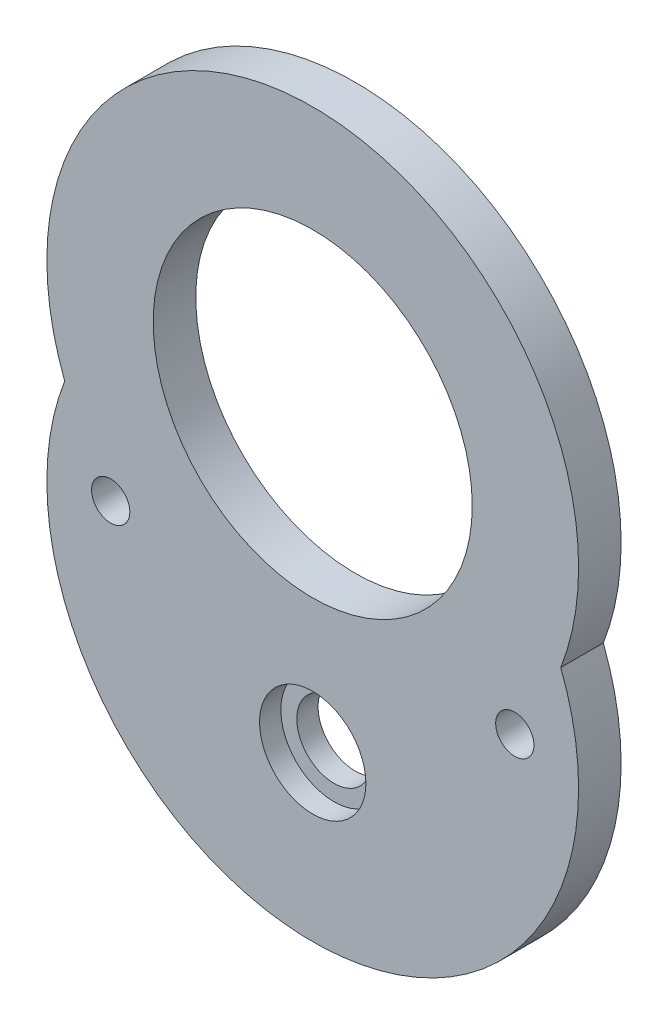
ISO-10303-21;
HEADER;
FILE_DESCRIPTION(('STEP AP214'),'2;1');
FILE_NAME('part.step','',(''),(''),'','','');
FILE_SCHEMA(('AUTOMOTIVE_DESIGN { 1 0 10303 214 1 1 1 1 }'));
ENDSEC;
DATA;
#1=APPLICATION_CONTEXT('core data for automotive mechanical design processes');
#2=APPLICATION_PROTOCOL_DEFINITION('international standard','automotive_design',2000,#1);
#3=PRODUCT_CONTEXT('',#1,'mechanical');
#4=PRODUCT('Part','Part','',(#3));
#5=PRODUCT_RELATED_PRODUCT_CATEGORY('part','',(#4));
#6=PRODUCT_DEFINITION_FORMATION('','',#4);
#7=PRODUCT_DEFINITION_CONTEXT('part definition',#1,'design');
#8=PRODUCT_DEFINITION('design','',#6,#7);
#9=PRODUCT_DEFINITION_SHAPE('','',#8);
#10=(LENGTH_UNIT() NAMED_UNIT(*) SI_UNIT(.MILLI.,.METRE.));
#11=(NAMED_UNIT(*) PLANE_ANGLE_UNIT() SI_UNIT($,.RADIAN.));
#12=(NAMED_UNIT(*) SI_UNIT($,.STERADIAN.) SOLID_ANGLE_UNIT());
#13=UNCERTAINTY_MEASURE_WITH_UNIT(LENGTH_MEASURE(1.E-05),#10,'distance_accuracy_value','');
#14=(GEOMETRIC_REPRESENTATION_CONTEXT(3) GLOBAL_UNCERTAINTY_ASSIGNED_CONTEXT((#13)) GLOBAL_UNIT_ASSIGNED_CONTEXT((#10,
#11,#12)) REPRESENTATION_CONTEXT('',''));
#15=CARTESIAN_POINT('',(0.,0.,0.));
#16=DIRECTION('',(0.,0.,1.));
#17=DIRECTION('',(1.,0.,0.));
#18=AXIS2_PLACEMENT_3D('',#15,#16,#17);
#19=CARTESIAN_POINT('',(0.,-13.8,2.));
#20=DIRECTION('',(0.,0.,-1.));
#21=DIRECTION('',(-1.,0.,0.));
#22=AXIS2_PLACEMENT_3D('',#19,#20,#21);
#23=CYLINDRICAL_SURFACE('',#22,1.75);
#24=CARTESIAN_POINT('',(0.,-13.8,0.));
#25=DIRECTION('',(0.,0.,1.));
#26=DIRECTION('',(1.,0.,0.));
#27=AXIS2_PLACEMENT_3D('',#24,#25,#26);
#28=CIRCLE('',#27,1.75);
#29=CARTESIAN_POINT('',(1.75,-13.8,0.));
#30=VERTEX_POINT('',#29);
#31=EDGE_CURVE('E85',#30,#30,#28,.T.);
#32=ORIENTED_EDGE('',*,*,#31,.F.);
#33=EDGE_LOOP('',(#32));
#34=FACE_BOUND('',#33,.T.);
#35=CARTESIAN_POINT('',(0.,-13.8,1.));
#36=DIRECTION('',(0.,0.,1.));
#37=DIRECTION('',(1.,0.,0.));
#38=AXIS2_PLACEMENT_3D('',#35,#36,#37);
#39=CIRCLE('',#38,1.75);
#40=CARTESIAN_POINT('',(1.75,-13.8,1.));
#41=VERTEX_POINT('',#40);
#42=EDGE_CURVE('E41',#41,#41,#39,.T.);
#43=ORIENTED_EDGE('',*,*,#42,.T.);
#44=EDGE_LOOP('',(#43));
#45=FACE_BOUND('',#44,.T.);
#46=ADVANCED_FACE('F37',(#34,#45),#23,.F.);
#47=CARTESIAN_POINT('',(0.,-4.5,2.));
#48=DIRECTION('',(0.,0.,1.));
#49=DIRECTION('',(1.,0.,0.));
#50=AXIS2_PLACEMENT_3D('',#47,#48,#49);
#51=PLANE('',#50);
#52=CARTESIAN_POINT('',(0.,-13.8,2.));
#53=DIRECTION('',(0.,0.,1.));
#54=DIRECTION('',(1.,0.,0.));
#55=AXIS2_PLACEMENT_3D('',#52,#53,#54);
#56=CIRCLE('',#55,2.5);
#57=CARTESIAN_POINT('',(2.5,-13.8,2.));
#58=VERTEX_POINT('',#57);
#59=EDGE_CURVE('E101',#58,#58,#56,.T.);
#60=ORIENTED_EDGE('',*,*,#59,.F.);
#61=EDGE_LOOP('',(#60));
#62=FACE_BOUND('',#61,.T.);
#63=CARTESIAN_POINT('',(-9.5,-8.3,2.));
#64=DIRECTION('',(0.,0.,1.));
#65=DIRECTION('',(1.,0.,0.));
#66=AXIS2_PLACEMENT_3D('',#63,#64,#65);
#67=CIRCLE('',#66,0.9);
#68=CARTESIAN_POINT('',(-8.6,-8.3,2.));
#69=VERTEX_POINT('',#68);
#70=EDGE_CURVE('E89',#69,#69,#67,.T.);
#71=ORIENTED_EDGE('',*,*,#70,.F.);
#72=EDGE_LOOP('',(#71));
#73=FACE_BOUND('',#72,.T.);
#74=CARTESIAN_POINT('',(0.,0.,2.));
#75=DIRECTION('',(0.,0.,1.));
#76=DIRECTION('',(1.,0.,0.));
#77=AXIS2_PLACEMENT_3D('',#74,#75,#76);
#78=CIRCLE('',#77,7.5);
#79=CARTESIAN_POINT('',(7.5,0.,2.));
#80=VERTEX_POINT('',#79);
#81=EDGE_CURVE('E76',#80,#80,#78,.T.);
#82=ORIENTED_EDGE('',*,*,#81,.F.);
#83=EDGE_LOOP('',(#82));
#84=FACE_BOUND('',#83,.T.);
#85=CARTESIAN_POINT('',(0.,-9.,2.));
#86=DIRECTION('',(0.,0.,1.));
#87=DIRECTION('',(1.,0.,0.));
#88=AXIS2_PLACEMENT_3D('',#85,#86,#87);
#89=CIRCLE('',#88,12.5);
#90=CARTESIAN_POINT('',(-11.6619037896906,-4.5,2.));
#91=VERTEX_POINT('',#90);
#92=CARTESIAN_POINT('',(11.6619037896906,-4.5,2.));
#93=VERTEX_POINT('',#92);
#94=EDGE_CURVE('E69',#91,#93,#89,.T.);
#95=ORIENTED_EDGE('',*,*,#94,.T.);
#96=CARTESIAN_POINT('',(0.,0.,2.));
#97=DIRECTION('',(0.,0.,1.));
#98=DIRECTION('',(1.,0.,0.));
#99=AXIS2_PLACEMENT_3D('',#96,#97,#98);
#100=CIRCLE('',#99,12.5);
#101=EDGE_CURVE('E54',#93,#91,#100,.T.);
#102=ORIENTED_EDGE('',*,*,#101,.T.);
#103=EDGE_LOOP('',(#95,#102));
#104=FACE_BOUND('',#103,.T.);
#105=CARTESIAN_POINT('',(9.5,-8.3,2.));
#106=DIRECTION('',(0.,0.,1.));
#107=DIRECTION('',(-1.,0.,0.));
#108=AXIS2_PLACEMENT_3D('',#105,#106,#107);
#109=CIRCLE('',#108,0.9);
#110=CARTESIAN_POINT('',(8.6,-8.3,2.));
#111=VERTEX_POINT('',#110);
#112=EDGE_CURVE('E93',#111,#111,#109,.T.);
#113=ORIENTED_EDGE('',*,*,#112,.F.);
#114=EDGE_LOOP('',(#113));
#115=FACE_BOUND('',#114,.T.);
#116=ADVANCED_FACE('F123',(#62,#73,#84,#104,#115),#51,.T.);
#117=CARTESIAN_POINT('',(0.,-4.5,0.));
#118=DIRECTION('',(0.,0.,1.));
#119=DIRECTION('',(1.,0.,0.));
#120=AXIS2_PLACEMENT_3D('',#117,#118,#119);
#121=PLANE('',#120);
#122=CARTESIAN_POINT('',(0.,-9.,0.));
#123=DIRECTION('',(0.,0.,1.));
#124=DIRECTION('',(1.,0.,0.));
#125=AXIS2_PLACEMENT_3D('',#122,#123,#124);
#126=CIRCLE('',#125,12.5);
#127=CARTESIAN_POINT('',(-11.6619037896906,-4.5,0.));
#128=VERTEX_POINT('',#127);
#129=CARTESIAN_POINT('',(11.6619037896906,-4.5,0.));
#130=VERTEX_POINT('',#129);
#131=EDGE_CURVE('E70',#128,#130,#126,.T.);
#132=ORIENTED_EDGE('',*,*,#131,.F.);
#133=CARTESIAN_POINT('',(0.,0.,0.));
#134=DIRECTION('',(0.,0.,1.));
#135=DIRECTION('',(1.,0.,0.));
#136=AXIS2_PLACEMENT_3D('',#133,#134,#135);
#137=CIRCLE('',#136,12.5);
#138=EDGE_CURVE('E62',#130,#128,#137,.T.);
#139=ORIENTED_EDGE('',*,*,#138,.F.);
#140=EDGE_LOOP('',(#132,#139));
#141=FACE_BOUND('',#140,.T.);
#142=CARTESIAN_POINT('',(0.,0.,0.));
#143=DIRECTION('',(0.,0.,1.));
#144=DIRECTION('',(1.,0.,0.));
#145=AXIS2_PLACEMENT_3D('',#142,#143,#144);
#146=CIRCLE('',#145,7.5);
#147=CARTESIAN_POINT('',(7.5,0.,0.));
#148=VERTEX_POINT('',#147);
#149=EDGE_CURVE('E79',#148,#148,#146,.T.);
#150=ORIENTED_EDGE('',*,*,#149,.T.);
#151=EDGE_LOOP('',(#150));
#152=FACE_BOUND('',#151,.T.);
#153=ORIENTED_EDGE('',*,*,#31,.T.);
#154=EDGE_LOOP('',(#153));
#155=FACE_BOUND('',#154,.T.);
#156=CARTESIAN_POINT('',(-9.5,-8.3,0.));
#157=DIRECTION('',(0.,0.,1.));
#158=DIRECTION('',(1.,0.,0.));
#159=AXIS2_PLACEMENT_3D('',#156,#157,#158);
#160=CIRCLE('',#159,0.9);
#161=CARTESIAN_POINT('',(-8.6,-8.3,0.));
#162=VERTEX_POINT('',#161);
#163=EDGE_CURVE('E90',#162,#162,#160,.T.);
#164=ORIENTED_EDGE('',*,*,#163,.T.);
#165=EDGE_LOOP('',(#164));
#166=FACE_BOUND('',#165,.T.);
#167=CARTESIAN_POINT('',(9.5,-8.3,0.));
#168=DIRECTION('',(0.,0.,1.));
#169=DIRECTION('',(-1.,0.,0.));
#170=AXIS2_PLACEMENT_3D('',#167,#168,#169);
#171=CIRCLE('',#170,0.9);
#172=CARTESIAN_POINT('',(8.6,-8.3,0.));
#173=VERTEX_POINT('',#172);
#174=EDGE_CURVE('E96',#173,#173,#171,.T.);
#175=ORIENTED_EDGE('',*,*,#174,.T.);
#176=EDGE_LOOP('',(#175));
#177=FACE_BOUND('',#176,.T.);
#178=ADVANCED_FACE('F74',(#141,#152,#155,#166,#177),#121,.F.);
#179=CARTESIAN_POINT('',(0.,-9.,2.));
#180=DIRECTION('',(0.,0.,-1.));
#181=DIRECTION('',(-1.,0.,0.));
#182=AXIS2_PLACEMENT_3D('',#179,#180,#181);
#183=CYLINDRICAL_SURFACE('',#182,12.5);
#184=ORIENTED_EDGE('',*,*,#131,.T.);
#185=DIRECTION('',(0.,0.,-1.));
#186=VECTOR('',#185,1.);
#187=CARTESIAN_POINT('',(11.6619037896906,-4.5,2.));
#188=LINE('',#187,#186);
#189=EDGE_CURVE('E11',#93,#130,#188,.T.);
#190=ORIENTED_EDGE('',*,*,#189,.F.);
#191=ORIENTED_EDGE('',*,*,#94,.F.);
#192=DIRECTION('',(0.,0.,-1.));
#193=VECTOR('',#192,1.);
#194=CARTESIAN_POINT('',(-11.6619037896906,-4.5,2.));
#195=LINE('',#194,#193);
#196=EDGE_CURVE('E47',#91,#128,#195,.T.);
#197=ORIENTED_EDGE('',*,*,#196,.T.);
#198=EDGE_LOOP('',(#184,#190,#191,#197));
#199=FACE_BOUND('',#198,.T.);
#200=ADVANCED_FACE('F39',(#199),#183,.T.);
#201=CARTESIAN_POINT('',(0.,0.,2.));
#202=DIRECTION('',(0.,0.,-1.));
#203=DIRECTION('',(-1.,0.,0.));
#204=AXIS2_PLACEMENT_3D('',#201,#202,#203);
#205=CYLINDRICAL_SURFACE('',#204,12.5);
#206=ORIENTED_EDGE('',*,*,#138,.T.);
#207=ORIENTED_EDGE('',*,*,#196,.F.);
#208=ORIENTED_EDGE('',*,*,#101,.F.);
#209=ORIENTED_EDGE('',*,*,#189,.T.);
#210=EDGE_LOOP('',(#206,#207,#208,#209));
#211=FACE_BOUND('',#210,.T.);
#212=ADVANCED_FACE('F65',(#211),#205,.T.);
#213=CARTESIAN_POINT('',(0.,0.,2.));
#214=DIRECTION('',(0.,0.,-1.));
#215=DIRECTION('',(-1.,0.,0.));
#216=AXIS2_PLACEMENT_3D('',#213,#214,#215);
#217=CYLINDRICAL_SURFACE('',#216,7.5);
#218=ORIENTED_EDGE('',*,*,#81,.T.);
#219=EDGE_LOOP('',(#218));
#220=FACE_BOUND('',#219,.T.);
#221=ORIENTED_EDGE('',*,*,#149,.F.);
#222=EDGE_LOOP('',(#221));
#223=FACE_BOUND('',#222,.T.);
#224=ADVANCED_FACE('F136',(#220,#223),#217,.F.);
#225=CARTESIAN_POINT('',(-9.5,-8.3,2.));
#226=DIRECTION('',(0.,0.,-1.));
#227=DIRECTION('',(-1.,0.,0.));
#228=AXIS2_PLACEMENT_3D('',#225,#226,#227);
#229=CYLINDRICAL_SURFACE('',#228,0.9);
#230=ORIENTED_EDGE('',*,*,#70,.T.);
#231=EDGE_LOOP('',(#230));
#232=FACE_BOUND('',#231,.T.);
#233=ORIENTED_EDGE('',*,*,#163,.F.);
#234=EDGE_LOOP('',(#233));
#235=FACE_BOUND('',#234,.T.);
#236=ADVANCED_FACE('F134',(#232,#235),#229,.F.);
#237=CARTESIAN_POINT('',(9.5,-8.3,2.));
#238=DIRECTION('',(0.,0.,-1.));
#239=DIRECTION('',(-1.,0.,0.));
#240=AXIS2_PLACEMENT_3D('',#237,#238,#239);
#241=CYLINDRICAL_SURFACE('',#240,0.9);
#242=ORIENTED_EDGE('',*,*,#112,.T.);
#243=EDGE_LOOP('',(#242));
#244=FACE_BOUND('',#243,.T.);
#245=ORIENTED_EDGE('',*,*,#174,.F.);
#246=EDGE_LOOP('',(#245));
#247=FACE_BOUND('',#246,.T.);
#248=ADVANCED_FACE('F119',(#244,#247),#241,.F.);
#249=CARTESIAN_POINT('',(0.,-13.8,1.));
#250=DIRECTION('',(0.,0.,1.));
#251=DIRECTION('',(1.,0.,0.));
#252=AXIS2_PLACEMENT_3D('',#249,#250,#251);
#253=CYLINDRICAL_SURFACE('',#252,2.5);
#254=CARTESIAN_POINT('',(0.,-13.8,1.));
#255=DIRECTION('',(0.,0.,1.));
#256=DIRECTION('',(1.,0.,0.));
#257=AXIS2_PLACEMENT_3D('',#254,#255,#256);
#258=CIRCLE('',#257,2.5);
#259=CARTESIAN_POINT('',(2.5,-13.8,1.));
#260=VERTEX_POINT('',#259);
#261=EDGE_CURVE('E104',#260,#260,#258,.T.);
#262=ORIENTED_EDGE('',*,*,#261,.F.);
#263=EDGE_LOOP('',(#262));
#264=FACE_BOUND('',#263,.T.);
#265=ORIENTED_EDGE('',*,*,#59,.T.);
#266=EDGE_LOOP('',(#265));
#267=FACE_BOUND('',#266,.T.);
#268=ADVANCED_FACE('F114',(#264,#267),#253,.F.);
#269=CARTESIAN_POINT('',(0.,-13.8,1.));
#270=DIRECTION('',(0.,0.,1.));
#271=DIRECTION('',(1.,0.,0.));
#272=AXIS2_PLACEMENT_3D('',#269,#270,#271);
#273=PLANE('',#272);
#274=ORIENTED_EDGE('',*,*,#42,.F.);
#275=EDGE_LOOP('',(#274));
#276=FACE_BOUND('',#275,.T.);
#277=ORIENTED_EDGE('',*,*,#261,.T.);
#278=EDGE_LOOP('',(#277));
#279=FACE_BOUND('',#278,.T.);
#280=ADVANCED_FACE('F112',(#276,#279),#273,.T.);
#281=CLOSED_SHELL('',(#46,#116,#178,#200,#212,#224,#236,#248,#268,#280));
#282=MANIFOLD_SOLID_BREP('B2',#281);
#283=ADVANCED_BREP_SHAPE_REPRESENTATION('',(#18,#282),#14);
#284=SHAPE_DEFINITION_REPRESENTATION(#9,#283);
ENDSEC;
END-ISO-10303-21;
